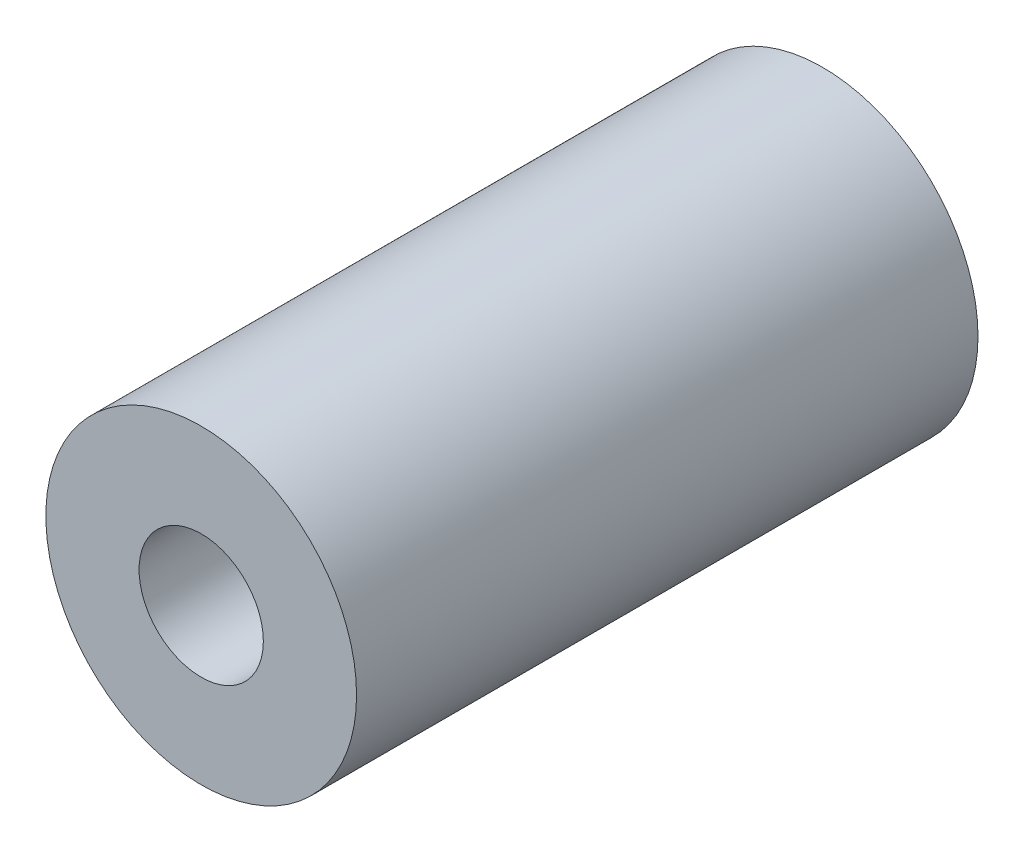
ISO-10303-21;
HEADER;
FILE_DESCRIPTION(('STEP AP214'),'2;1');
FILE_NAME('part.step','',(''),(''),'','','');
FILE_SCHEMA(('AUTOMOTIVE_DESIGN { 1 0 10303 214 1 1 1 1 }'));
ENDSEC;
DATA;
#1=APPLICATION_CONTEXT('core data for automotive mechanical design processes');
#2=APPLICATION_PROTOCOL_DEFINITION('international standard','automotive_design',2000,#1);
#3=PRODUCT_CONTEXT('',#1,'mechanical');
#4=PRODUCT('Part','Part','',(#3));
#5=PRODUCT_RELATED_PRODUCT_CATEGORY('part','',(#4));
#6=PRODUCT_DEFINITION_FORMATION('','',#4);
#7=PRODUCT_DEFINITION_CONTEXT('part definition',#1,'design');
#8=PRODUCT_DEFINITION('design','',#6,#7);
#9=PRODUCT_DEFINITION_SHAPE('','',#8);
#10=(LENGTH_UNIT() NAMED_UNIT(*) SI_UNIT(.MILLI.,.METRE.));
#11=(NAMED_UNIT(*) PLANE_ANGLE_UNIT() SI_UNIT($,.RADIAN.));
#12=(NAMED_UNIT(*) SI_UNIT($,.STERADIAN.) SOLID_ANGLE_UNIT());
#13=UNCERTAINTY_MEASURE_WITH_UNIT(LENGTH_MEASURE(1.E-05),#10,'distance_accuracy_value','');
#14=(GEOMETRIC_REPRESENTATION_CONTEXT(3) GLOBAL_UNCERTAINTY_ASSIGNED_CONTEXT((#13)) GLOBAL_UNIT_ASSIGNED_CONTEXT((#10,
#11,#12)) REPRESENTATION_CONTEXT('',''));
#15=CARTESIAN_POINT('',(0.,0.,0.));
#16=DIRECTION('',(0.,0.,1.));
#17=DIRECTION('',(1.,0.,0.));
#18=AXIS2_PLACEMENT_3D('',#15,#16,#17);
#19=CARTESIAN_POINT('',(0.,0.,10.));
#20=DIRECTION('',(0.,0.,1.));
#21=DIRECTION('',(1.,0.,0.));
#22=AXIS2_PLACEMENT_3D('',#19,#20,#21);
#23=PLANE('',#22);
#24=CARTESIAN_POINT('',(0.,0.,10.));
#25=DIRECTION('',(0.,0.,1.));
#26=DIRECTION('',(1.,0.,0.));
#27=AXIS2_PLACEMENT_3D('',#24,#25,#26);
#28=CIRCLE('',#27,5.);
#29=CARTESIAN_POINT('',(5.,0.,10.));
#30=VERTEX_POINT('',#29);
#31=EDGE_CURVE('E10',#30,#30,#28,.T.);
#32=ORIENTED_EDGE('',*,*,#31,.T.);
#33=EDGE_LOOP('',(#32));
#34=FACE_BOUND('',#33,.T.);
#35=CARTESIAN_POINT('',(0.,0.,10.));
#36=DIRECTION('',(0.,0.,1.));
#37=DIRECTION('',(1.,0.,0.));
#38=AXIS2_PLACEMENT_3D('',#35,#36,#37);
#39=CIRCLE('',#38,2.);
#40=CARTESIAN_POINT('',(2.,0.,10.));
#41=VERTEX_POINT('',#40);
#42=EDGE_CURVE('E45',#41,#41,#39,.T.);
#43=ORIENTED_EDGE('',*,*,#42,.F.);
#44=EDGE_LOOP('',(#43));
#45=FACE_BOUND('',#44,.T.);
#46=ADVANCED_FACE('F34',(#34,#45),#23,.T.);
#47=CARTESIAN_POINT('',(0.,0.,-10.));
#48=DIRECTION('',(0.,0.,1.));
#49=DIRECTION('',(1.,0.,0.));
#50=AXIS2_PLACEMENT_3D('',#47,#48,#49);
#51=PLANE('',#50);
#52=CARTESIAN_POINT('',(0.,0.,-10.));
#53=DIRECTION('',(0.,0.,1.));
#54=DIRECTION('',(1.,0.,0.));
#55=AXIS2_PLACEMENT_3D('',#52,#53,#54);
#56=CIRCLE('',#55,5.);
#57=CARTESIAN_POINT('',(5.,0.,-10.));
#58=VERTEX_POINT('',#57);
#59=EDGE_CURVE('E38',#58,#58,#56,.T.);
#60=ORIENTED_EDGE('',*,*,#59,.F.);
#61=EDGE_LOOP('',(#60));
#62=FACE_BOUND('',#61,.T.);
#63=CARTESIAN_POINT('',(0.,0.,-10.));
#64=DIRECTION('',(0.,0.,1.));
#65=DIRECTION('',(1.,0.,0.));
#66=AXIS2_PLACEMENT_3D('',#63,#64,#65);
#67=CIRCLE('',#66,2.);
#68=CARTESIAN_POINT('',(2.,0.,-10.));
#69=VERTEX_POINT('',#68);
#70=EDGE_CURVE('E47',#69,#69,#67,.T.);
#71=ORIENTED_EDGE('',*,*,#70,.T.);
#72=EDGE_LOOP('',(#71));
#73=FACE_BOUND('',#72,.T.);
#74=ADVANCED_FACE('F57',(#62,#73),#51,.F.);
#75=CARTESIAN_POINT('',(0.,0.,10.));
#76=DIRECTION('',(0.,0.,-1.));
#77=DIRECTION('',(-1.,0.,0.));
#78=AXIS2_PLACEMENT_3D('',#75,#76,#77);
#79=CYLINDRICAL_SURFACE('',#78,5.);
#80=ORIENTED_EDGE('',*,*,#31,.F.);
#81=EDGE_LOOP('',(#80));
#82=FACE_BOUND('',#81,.T.);
#83=ORIENTED_EDGE('',*,*,#59,.T.);
#84=EDGE_LOOP('',(#83));
#85=FACE_BOUND('',#84,.T.);
#86=ADVANCED_FACE('F36',(#82,#85),#79,.T.);
#87=CARTESIAN_POINT('',(0.,0.,10.));
#88=DIRECTION('',(0.,0.,-1.));
#89=DIRECTION('',(-1.,0.,0.));
#90=AXIS2_PLACEMENT_3D('',#87,#88,#89);
#91=CYLINDRICAL_SURFACE('',#90,2.);
#92=ORIENTED_EDGE('',*,*,#42,.T.);
#93=EDGE_LOOP('',(#92));
#94=FACE_BOUND('',#93,.T.);
#95=ORIENTED_EDGE('',*,*,#70,.F.);
#96=EDGE_LOOP('',(#95));
#97=FACE_BOUND('',#96,.T.);
#98=ADVANCED_FACE('F53',(#94,#97),#91,.F.);
#99=CLOSED_SHELL('',(#46,#74,#86,#98));
#100=MANIFOLD_SOLID_BREP('B2',#99);
#101=ADVANCED_BREP_SHAPE_REPRESENTATION('',(#18,#100),#14);
#102=SHAPE_DEFINITION_REPRESENTATION(#9,#101);
ENDSEC;
END-ISO-10303-21;
